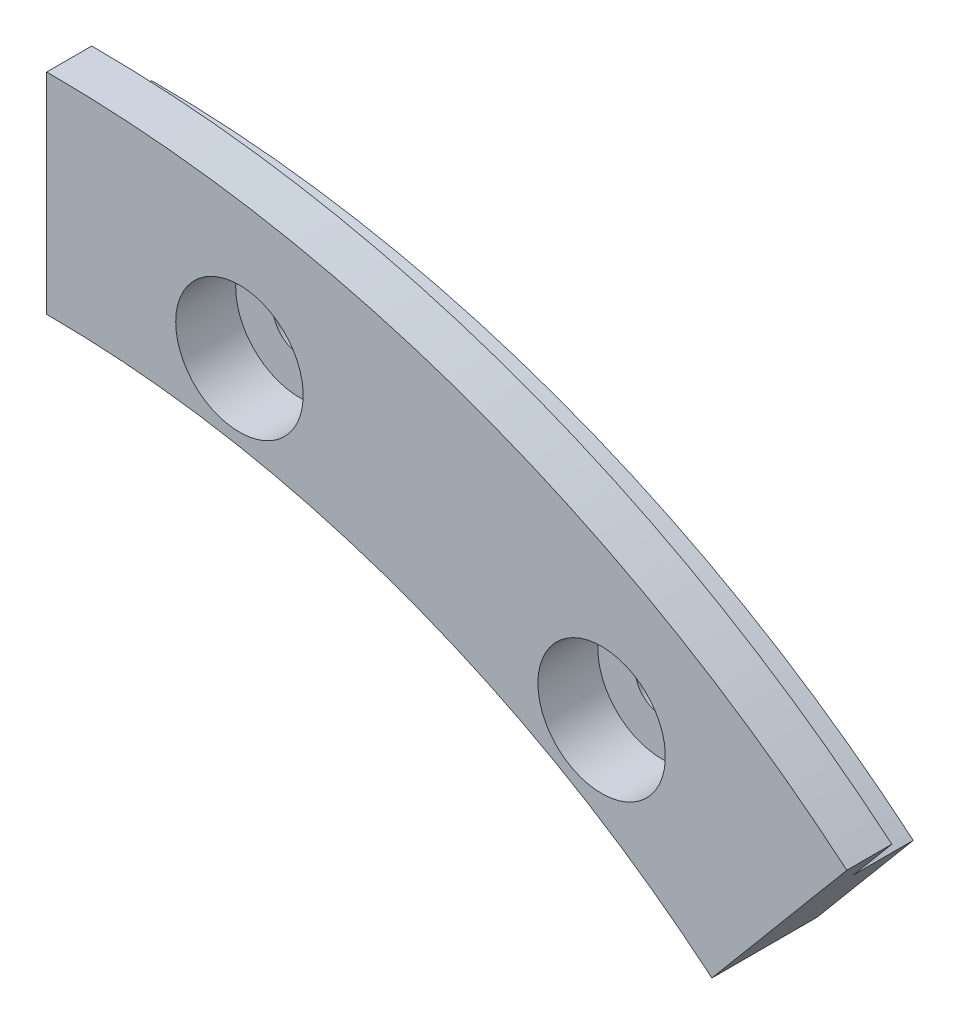
ISO-10303-21;
HEADER;
FILE_DESCRIPTION(('STEP AP214'),'2;1');
FILE_NAME('part.step','',(''),(''),'','','');
FILE_SCHEMA(('AUTOMOTIVE_DESIGN { 1 0 10303 214 1 1 1 1 }'));
ENDSEC;
DATA;
#1=APPLICATION_CONTEXT('core data for automotive mechanical design processes');
#2=APPLICATION_PROTOCOL_DEFINITION('international standard','automotive_design',2000,#1);
#3=PRODUCT_CONTEXT('',#1,'mechanical');
#4=PRODUCT('Part','Part','',(#3));
#5=PRODUCT_RELATED_PRODUCT_CATEGORY('part','',(#4));
#6=PRODUCT_DEFINITION_FORMATION('','',#4);
#7=PRODUCT_DEFINITION_CONTEXT('part definition',#1,'design');
#8=PRODUCT_DEFINITION('design','',#6,#7);
#9=PRODUCT_DEFINITION_SHAPE('','',#8);
#10=(LENGTH_UNIT() NAMED_UNIT(*) SI_UNIT(.MILLI.,.METRE.));
#11=(NAMED_UNIT(*) PLANE_ANGLE_UNIT() SI_UNIT($,.RADIAN.));
#12=(NAMED_UNIT(*) SI_UNIT($,.STERADIAN.) SOLID_ANGLE_UNIT());
#13=UNCERTAINTY_MEASURE_WITH_UNIT(LENGTH_MEASURE(1.E-05),#10,'distance_accuracy_value','');
#14=(GEOMETRIC_REPRESENTATION_CONTEXT(3) GLOBAL_UNCERTAINTY_ASSIGNED_CONTEXT((#13)) GLOBAL_UNIT_ASSIGNED_CONTEXT((#10,
#11,#12)) REPRESENTATION_CONTEXT('',''));
#15=CARTESIAN_POINT('',(0.,0.,0.));
#16=DIRECTION('',(0.,0.,1.));
#17=DIRECTION('',(1.,0.,0.));
#18=AXIS2_PLACEMENT_3D('',#15,#16,#17);
#19=CARTESIAN_POINT('',(0.,0.,4.));
#20=DIRECTION('',(0.,0.,-1.));
#21=DIRECTION('',(-1.,0.,0.));
#22=AXIS2_PLACEMENT_3D('',#19,#20,#21);
#23=CYLINDRICAL_SURFACE('',#22,79.);
#24=CARTESIAN_POINT('',(0.,0.,0.));
#25=DIRECTION('',(0.,0.,1.));
#26=DIRECTION('',(-1.,0.,0.));
#27=AXIS2_PLACEMENT_3D('',#24,#25,#26);
#28=CIRCLE('',#27,79.);
#29=CARTESIAN_POINT('',(50.7802211652362,60.5175110063996,0.));
#30=VERTEX_POINT('',#29);
#31=CARTESIAN_POINT('',(0.,79.,0.));
#32=VERTEX_POINT('',#31);
#33=EDGE_CURVE('E93',#30,#32,#28,.T.);
#34=ORIENTED_EDGE('',*,*,#33,.T.);
#35=DIRECTION('',(0.,0.,-1.));
#36=VECTOR('',#35,1.);
#37=CARTESIAN_POINT('',(0.,79.,4.));
#38=LINE('',#37,#36);
#39=CARTESIAN_POINT('',(0.,79.,4.));
#40=VERTEX_POINT('',#39);
#41=EDGE_CURVE('E11',#40,#32,#38,.T.);
#42=ORIENTED_EDGE('',*,*,#41,.F.);
#43=CARTESIAN_POINT('',(0.,0.,4.));
#44=DIRECTION('',(0.,0.,1.));
#45=DIRECTION('',(-1.,0.,0.));
#46=AXIS2_PLACEMENT_3D('',#43,#44,#45);
#47=CIRCLE('',#46,79.);
#48=CARTESIAN_POINT('',(50.7802211652362,60.5175110063996,4.));
#49=VERTEX_POINT('',#48);
#50=EDGE_CURVE('E94',#49,#40,#47,.T.);
#51=ORIENTED_EDGE('',*,*,#50,.F.);
#52=DIRECTION('',(0.,0.,-1.));
#53=VECTOR('',#52,1.);
#54=CARTESIAN_POINT('',(50.7802211652362,60.5175110063996,4.));
#55=LINE('',#54,#53);
#56=EDGE_CURVE('E54',#49,#30,#55,.T.);
#57=ORIENTED_EDGE('',*,*,#56,.T.);
#58=EDGE_LOOP('',(#34,#42,#51,#57));
#59=FACE_BOUND('',#58,.T.);
#60=ADVANCED_FACE('F37',(#59),#23,.T.);
#61=CARTESIAN_POINT('',(0.,79.,4.));
#62=DIRECTION('',(1.,0.,0.));
#63=DIRECTION('',(0.,1.,0.));
#64=AXIS2_PLACEMENT_3D('',#61,#62,#63);
#65=PLANE('',#64);
#66=DIRECTION('',(0.,-1.,0.));
#67=VECTOR('',#66,1.);
#68=CARTESIAN_POINT('',(0.,79.,0.));
#69=LINE('',#68,#67);
#70=CARTESIAN_POINT('',(0.,69.,0.));
#71=VERTEX_POINT('',#70);
#72=EDGE_CURVE('E82',#32,#71,#69,.T.);
#73=ORIENTED_EDGE('',*,*,#72,.T.);
#74=DIRECTION('',(0.,0.,-1.));
#75=VECTOR('',#74,1.);
#76=CARTESIAN_POINT('',(0.,69.,4.));
#77=LINE('',#76,#75);
#78=CARTESIAN_POINT('',(0.,69.,7.));
#79=VERTEX_POINT('',#78);
#80=EDGE_CURVE('E46',#79,#71,#77,.T.);
#81=ORIENTED_EDGE('',*,*,#80,.F.);
#82=DIRECTION('',(0.,-1.,0.));
#83=VECTOR('',#82,1.);
#84=CARTESIAN_POINT('',(0.,83.,7.));
#85=LINE('',#84,#83);
#86=CARTESIAN_POINT('',(0.,83.,7.));
#87=VERTEX_POINT('',#86);
#88=EDGE_CURVE('E135',#87,#79,#85,.T.);
#89=ORIENTED_EDGE('',*,*,#88,.F.);
#90=DIRECTION('',(0.,0.,-1.));
#91=VECTOR('',#90,1.);
#92=CARTESIAN_POINT('',(0.,83.,7.));
#93=LINE('',#92,#91);
#94=CARTESIAN_POINT('',(0.,83.,4.));
#95=VERTEX_POINT('',#94);
#96=EDGE_CURVE('E138',#87,#95,#93,.T.);
#97=ORIENTED_EDGE('',*,*,#96,.T.);
#98=DIRECTION('',(0.,-1.,0.));
#99=VECTOR('',#98,1.);
#100=CARTESIAN_POINT('',(0.,83.,4.));
#101=LINE('',#100,#99);
#102=EDGE_CURVE('E130',#95,#40,#101,.T.);
#103=ORIENTED_EDGE('',*,*,#102,.T.);
#104=ORIENTED_EDGE('',*,*,#41,.T.);
#105=EDGE_LOOP('',(#73,#81,#89,#97,#103,#104));
#106=FACE_BOUND('',#105,.T.);
#107=ADVANCED_FACE('F151',(#106),#65,.F.);
#108=CARTESIAN_POINT('',(0.,0.,4.));
#109=DIRECTION('',(0.,0.,-1.));
#110=DIRECTION('',(-1.,0.,0.));
#111=AXIS2_PLACEMENT_3D('',#108,#109,#110);
#112=CYLINDRICAL_SURFACE('',#111,69.);
#113=CARTESIAN_POINT('',(0.,0.,0.));
#114=DIRECTION('',(0.,0.,-1.));
#115=DIRECTION('',(-1.,0.,0.));
#116=AXIS2_PLACEMENT_3D('',#113,#114,#115);
#117=CIRCLE('',#116,69.);
#118=CARTESIAN_POINT('',(44.3523450683709,52.8570665752098,0.));
#119=VERTEX_POINT('',#118);
#120=EDGE_CURVE('E71',#71,#119,#117,.T.);
#121=ORIENTED_EDGE('',*,*,#120,.T.);
#122=DIRECTION('',(0.,0.,-1.));
#123=VECTOR('',#122,1.);
#124=CARTESIAN_POINT('',(44.3523450683709,52.8570665752098,4.));
#125=LINE('',#124,#123);
#126=CARTESIAN_POINT('',(44.3523450683709,52.8570665752098,7.));
#127=VERTEX_POINT('',#126);
#128=EDGE_CURVE('E76',#127,#119,#125,.T.);
#129=ORIENTED_EDGE('',*,*,#128,.F.);
#130=CARTESIAN_POINT('',(0.,0.,7.));
#131=DIRECTION('',(0.,0.,-1.));
#132=DIRECTION('',(1.,0.,0.));
#133=AXIS2_PLACEMENT_3D('',#130,#131,#132);
#134=CIRCLE('',#133,69.);
#135=EDGE_CURVE('E128',#79,#127,#134,.T.);
#136=ORIENTED_EDGE('',*,*,#135,.F.);
#137=ORIENTED_EDGE('',*,*,#80,.T.);
#138=EDGE_LOOP('',(#121,#129,#136,#137));
#139=FACE_BOUND('',#138,.T.);
#140=ADVANCED_FACE('F73',(#139),#112,.F.);
#141=CARTESIAN_POINT('',(44.3523450683709,52.8570665752098,4.));
#142=DIRECTION('',(-0.766044443118982,0.642787609686534,0.));
#143=DIRECTION('',(-0.642787609686534,-0.766044443118982,0.));
#144=AXIS2_PLACEMENT_3D('',#141,#142,#143);
#145=PLANE('',#144);
#146=DIRECTION('',(0.642787609686534,0.766044443118982,0.));
#147=VECTOR('',#146,1.);
#148=CARTESIAN_POINT('',(44.3523450683709,52.8570665752098,0.));
#149=LINE('',#148,#147);
#150=EDGE_CURVE('E81',#119,#30,#149,.T.);
#151=ORIENTED_EDGE('',*,*,#150,.T.);
#152=ORIENTED_EDGE('',*,*,#56,.F.);
#153=DIRECTION('',(0.642787609686535,0.766044443118982,0.));
#154=VECTOR('',#153,1.);
#155=CARTESIAN_POINT('',(44.3523450683709,52.8570665752098,4.));
#156=LINE('',#155,#154);
#157=CARTESIAN_POINT('',(53.3513716039824,63.5816887788755,4.));
#158=VERTEX_POINT('',#157);
#159=EDGE_CURVE('E125',#49,#158,#156,.T.);
#160=ORIENTED_EDGE('',*,*,#159,.T.);
#161=DIRECTION('',(0.,0.,-1.));
#162=VECTOR('',#161,1.);
#163=CARTESIAN_POINT('',(53.3513716039824,63.5816887788755,7.));
#164=LINE('',#163,#162);
#165=CARTESIAN_POINT('',(53.3513716039824,63.5816887788755,7.));
#166=VERTEX_POINT('',#165);
#167=EDGE_CURVE('E147',#166,#158,#164,.T.);
#168=ORIENTED_EDGE('',*,*,#167,.F.);
#169=DIRECTION('',(0.642787609686535,0.766044443118982,0.));
#170=VECTOR('',#169,1.);
#171=CARTESIAN_POINT('',(44.3523450683709,52.8570665752098,7.));
#172=LINE('',#171,#170);
#173=EDGE_CURVE('E87',#127,#166,#172,.T.);
#174=ORIENTED_EDGE('',*,*,#173,.F.);
#175=ORIENTED_EDGE('',*,*,#128,.T.);
#176=EDGE_LOOP('',(#151,#152,#160,#168,#174,#175));
#177=FACE_BOUND('',#176,.T.);
#178=ADVANCED_FACE('F84',(#177),#145,.F.);
#179=CARTESIAN_POINT('',(0.,0.,0.));
#180=DIRECTION('',(0.,0.,-1.));
#181=DIRECTION('',(-1.,0.,0.));
#182=AXIS2_PLACEMENT_3D('',#179,#180,#181);
#183=PLANE('',#182);
#184=CARTESIAN_POINT('',(12.8499651473529,72.8757737229034,0.));
#185=DIRECTION('',(0.,0.,1.));
#186=DIRECTION('',(1.,0.,0.));
#187=AXIS2_PLACEMENT_3D('',#184,#185,#186);
#188=CIRCLE('',#187,1.75);
#189=CARTESIAN_POINT('',(14.5999651473529,72.8757737229034,0.));
#190=VERTEX_POINT('',#189);
#191=EDGE_CURVE('E122',#190,#190,#188,.T.);
#192=ORIENTED_EDGE('',*,*,#191,.T.);
#193=EDGE_LOOP('',(#192));
#194=FACE_BOUND('',#193,.T.);
#195=CARTESIAN_POINT('',(36.9999999999996,64.0858798800487,0.));
#196=DIRECTION('',(0.,0.,1.));
#197=DIRECTION('',(1.,0.,0.));
#198=AXIS2_PLACEMENT_3D('',#195,#196,#197);
#199=CIRCLE('',#198,1.75);
#200=CARTESIAN_POINT('',(38.7499999999996,64.0858798800487,0.));
#201=VERTEX_POINT('',#200);
#202=EDGE_CURVE('E107',#201,#201,#199,.T.);
#203=ORIENTED_EDGE('',*,*,#202,.T.);
#204=EDGE_LOOP('',(#203));
#205=FACE_BOUND('',#204,.T.);
#206=ORIENTED_EDGE('',*,*,#33,.F.);
#207=ORIENTED_EDGE('',*,*,#150,.F.);
#208=ORIENTED_EDGE('',*,*,#120,.F.);
#209=ORIENTED_EDGE('',*,*,#72,.F.);
#210=EDGE_LOOP('',(#206,#207,#208,#209));
#211=FACE_BOUND('',#210,.T.);
#212=ADVANCED_FACE('F91',(#194,#205,#211),#183,.T.);
#213=CARTESIAN_POINT('',(0.,0.,7.));
#214=DIRECTION('',(0.,0.,-1.));
#215=DIRECTION('',(-1.,0.,0.));
#216=AXIS2_PLACEMENT_3D('',#213,#214,#215);
#217=CYLINDRICAL_SURFACE('',#216,83.);
#218=CARTESIAN_POINT('',(0.,0.,4.));
#219=DIRECTION('',(0.,0.,1.));
#220=DIRECTION('',(1.,0.,0.));
#221=AXIS2_PLACEMENT_3D('',#218,#219,#220);
#222=CIRCLE('',#221,83.);
#223=EDGE_CURVE('E140',#158,#95,#222,.T.);
#224=ORIENTED_EDGE('',*,*,#223,.T.);
#225=ORIENTED_EDGE('',*,*,#96,.F.);
#226=CARTESIAN_POINT('',(0.,0.,7.));
#227=DIRECTION('',(0.,0.,1.));
#228=DIRECTION('',(1.,0.,0.));
#229=AXIS2_PLACEMENT_3D('',#226,#227,#228);
#230=CIRCLE('',#229,83.);
#231=EDGE_CURVE('E132',#166,#87,#230,.T.);
#232=ORIENTED_EDGE('',*,*,#231,.F.);
#233=ORIENTED_EDGE('',*,*,#167,.T.);
#234=EDGE_LOOP('',(#224,#225,#232,#233));
#235=FACE_BOUND('',#234,.T.);
#236=ADVANCED_FACE('F167',(#235),#217,.T.);
#237=CARTESIAN_POINT('',(0.,0.,7.));
#238=DIRECTION('',(0.,0.,1.));
#239=DIRECTION('',(1.,0.,0.));
#240=AXIS2_PLACEMENT_3D('',#237,#238,#239);
#241=PLANE('',#240);
#242=CARTESIAN_POINT('',(12.8499651473529,72.8757737229034,7.));
#243=DIRECTION('',(0.,0.,-1.));
#244=DIRECTION('',(-1.,0.,0.));
#245=AXIS2_PLACEMENT_3D('',#242,#243,#244);
#246=CIRCLE('',#245,4.25);
#247=CARTESIAN_POINT('',(8.59996514735287,72.8757737229034,7.));
#248=VERTEX_POINT('',#247);
#249=EDGE_CURVE('E109',#248,#248,#246,.T.);
#250=ORIENTED_EDGE('',*,*,#249,.T.);
#251=EDGE_LOOP('',(#250));
#252=FACE_BOUND('',#251,.T.);
#253=CARTESIAN_POINT('',(36.9999999999996,64.0858798800487,7.));
#254=DIRECTION('',(0.,0.,-1.));
#255=DIRECTION('',(-1.,0.,0.));
#256=AXIS2_PLACEMENT_3D('',#253,#254,#255);
#257=CIRCLE('',#256,4.25);
#258=CARTESIAN_POINT('',(32.7499999999996,64.0858798800487,7.));
#259=VERTEX_POINT('',#258);
#260=EDGE_CURVE('E114',#259,#259,#257,.T.);
#261=ORIENTED_EDGE('',*,*,#260,.T.);
#262=EDGE_LOOP('',(#261));
#263=FACE_BOUND('',#262,.T.);
#264=ORIENTED_EDGE('',*,*,#135,.T.);
#265=ORIENTED_EDGE('',*,*,#173,.T.);
#266=ORIENTED_EDGE('',*,*,#231,.T.);
#267=ORIENTED_EDGE('',*,*,#88,.T.);
#268=EDGE_LOOP('',(#264,#265,#266,#267));
#269=FACE_BOUND('',#268,.T.);
#270=ADVANCED_FACE('F172',(#252,#263,#269),#241,.T.);
#271=CARTESIAN_POINT('',(0.,0.,4.));
#272=DIRECTION('',(0.,0.,1.));
#273=DIRECTION('',(1.,0.,0.));
#274=AXIS2_PLACEMENT_3D('',#271,#272,#273);
#275=PLANE('',#274);
#276=ORIENTED_EDGE('',*,*,#159,.F.);
#277=ORIENTED_EDGE('',*,*,#50,.T.);
#278=ORIENTED_EDGE('',*,*,#102,.F.);
#279=ORIENTED_EDGE('',*,*,#223,.F.);
#280=EDGE_LOOP('',(#276,#277,#278,#279));
#281=FACE_BOUND('',#280,.T.);
#282=ADVANCED_FACE('F160',(#281),#275,.F.);
#283=CARTESIAN_POINT('',(36.9999999999996,64.0858798800487,0.));
#284=DIRECTION('',(0.,0.,1.));
#285=DIRECTION('',(1.,0.,0.));
#286=AXIS2_PLACEMENT_3D('',#283,#284,#285);
#287=CYLINDRICAL_SURFACE('',#286,1.75);
#288=CARTESIAN_POINT('',(36.9999999999996,64.0858798800487,3.));
#289=DIRECTION('',(0.,0.,-1.));
#290=DIRECTION('',(-1.,0.,0.));
#291=AXIS2_PLACEMENT_3D('',#288,#289,#290);
#292=CIRCLE('',#291,1.75);
#293=CARTESIAN_POINT('',(35.2499999999996,64.0858798800487,3.));
#294=VERTEX_POINT('',#293);
#295=EDGE_CURVE('E40',#294,#294,#292,.F.);
#296=ORIENTED_EDGE('',*,*,#295,.T.);
#297=EDGE_LOOP('',(#296));
#298=FACE_BOUND('',#297,.T.);
#299=ORIENTED_EDGE('',*,*,#202,.F.);
#300=EDGE_LOOP('',(#299));
#301=FACE_BOUND('',#300,.T.);
#302=ADVANCED_FACE('F184',(#298,#301),#287,.F.);
#303=CARTESIAN_POINT('',(12.8499651473529,72.8757737229034,0.));
#304=DIRECTION('',(0.,0.,1.));
#305=DIRECTION('',(1.,0.,0.));
#306=AXIS2_PLACEMENT_3D('',#303,#304,#305);
#307=CYLINDRICAL_SURFACE('',#306,1.75);
#308=CARTESIAN_POINT('',(12.8499651473529,72.8757737229034,3.));
#309=DIRECTION('',(0.,0.,-1.));
#310=DIRECTION('',(-1.,0.,0.));
#311=AXIS2_PLACEMENT_3D('',#308,#309,#310);
#312=CIRCLE('',#311,1.75);
#313=CARTESIAN_POINT('',(11.0999651473529,72.8757737229034,3.));
#314=VERTEX_POINT('',#313);
#315=EDGE_CURVE('E101',#314,#314,#312,.F.);
#316=ORIENTED_EDGE('',*,*,#315,.T.);
#317=EDGE_LOOP('',(#316));
#318=FACE_BOUND('',#317,.T.);
#319=ORIENTED_EDGE('',*,*,#191,.F.);
#320=EDGE_LOOP('',(#319));
#321=FACE_BOUND('',#320,.T.);
#322=ADVANCED_FACE('F210',(#318,#321),#307,.F.);
#323=CARTESIAN_POINT('',(12.8499651473529,72.8757737229034,3.));
#324=DIRECTION('',(0.,0.,-1.));
#325=DIRECTION('',(-1.,0.,0.));
#326=AXIS2_PLACEMENT_3D('',#323,#324,#325);
#327=PLANE('',#326);
#328=CARTESIAN_POINT('',(12.8499651473529,72.8757737229034,3.));
#329=DIRECTION('',(0.,0.,-1.));
#330=DIRECTION('',(-1.,0.,0.));
#331=AXIS2_PLACEMENT_3D('',#328,#329,#330);
#332=CIRCLE('',#331,4.25);
#333=CARTESIAN_POINT('',(8.59996514735287,72.8757737229034,3.));
#334=VERTEX_POINT('',#333);
#335=EDGE_CURVE('E103',#334,#334,#332,.T.);
#336=ORIENTED_EDGE('',*,*,#335,.F.);
#337=EDGE_LOOP('',(#336));
#338=FACE_BOUND('',#337,.T.);
#339=ORIENTED_EDGE('',*,*,#315,.F.);
#340=EDGE_LOOP('',(#339));
#341=FACE_BOUND('',#340,.T.);
#342=ADVANCED_FACE('F214',(#338,#341),#327,.F.);
#343=CARTESIAN_POINT('',(12.8499651473529,72.8757737229034,3.));
#344=DIRECTION('',(0.,0.,1.));
#345=DIRECTION('',(1.,0.,0.));
#346=AXIS2_PLACEMENT_3D('',#343,#344,#345);
#347=CYLINDRICAL_SURFACE('',#346,4.25);
#348=ORIENTED_EDGE('',*,*,#335,.T.);
#349=EDGE_LOOP('',(#348));
#350=FACE_BOUND('',#349,.T.);
#351=ORIENTED_EDGE('',*,*,#249,.F.);
#352=EDGE_LOOP('',(#351));
#353=FACE_BOUND('',#352,.T.);
#354=ADVANCED_FACE('F221',(#350,#353),#347,.F.);
#355=CARTESIAN_POINT('',(36.9999999999996,64.0858798800487,3.));
#356=DIRECTION('',(0.,0.,-1.));
#357=DIRECTION('',(-1.,0.,0.));
#358=AXIS2_PLACEMENT_3D('',#355,#356,#357);
#359=PLANE('',#358);
#360=CARTESIAN_POINT('',(36.9999999999996,64.0858798800487,3.));
#361=DIRECTION('',(0.,0.,-1.));
#362=DIRECTION('',(-1.,0.,0.));
#363=AXIS2_PLACEMENT_3D('',#360,#361,#362);
#364=CIRCLE('',#363,4.25);
#365=CARTESIAN_POINT('',(32.7499999999996,64.0858798800487,3.));
#366=VERTEX_POINT('',#365);
#367=EDGE_CURVE('E119',#366,#366,#364,.T.);
#368=ORIENTED_EDGE('',*,*,#367,.F.);
#369=EDGE_LOOP('',(#368));
#370=FACE_BOUND('',#369,.T.);
#371=ORIENTED_EDGE('',*,*,#295,.F.);
#372=EDGE_LOOP('',(#371));
#373=FACE_BOUND('',#372,.T.);
#374=ADVANCED_FACE('F217',(#370,#373),#359,.F.);
#375=CARTESIAN_POINT('',(36.9999999999996,64.0858798800487,3.));
#376=DIRECTION('',(0.,0.,1.));
#377=DIRECTION('',(1.,0.,0.));
#378=AXIS2_PLACEMENT_3D('',#375,#376,#377);
#379=CYLINDRICAL_SURFACE('',#378,4.25);
#380=ORIENTED_EDGE('',*,*,#367,.T.);
#381=EDGE_LOOP('',(#380));
#382=FACE_BOUND('',#381,.T.);
#383=ORIENTED_EDGE('',*,*,#260,.F.);
#384=EDGE_LOOP('',(#383));
#385=FACE_BOUND('',#384,.T.);
#386=ADVANCED_FACE('F220',(#382,#385),#379,.F.);
#387=CLOSED_SHELL('',(#60,#107,#140,#178,#212,#236,#270,#282,#302,#322,#342,#354,#374,#386));
#388=MANIFOLD_SOLID_BREP('B2',#387);
#389=ADVANCED_BREP_SHAPE_REPRESENTATION('',(#18,#388),#14);
#390=SHAPE_DEFINITION_REPRESENTATION(#9,#389);
ENDSEC;
END-ISO-10303-21;
